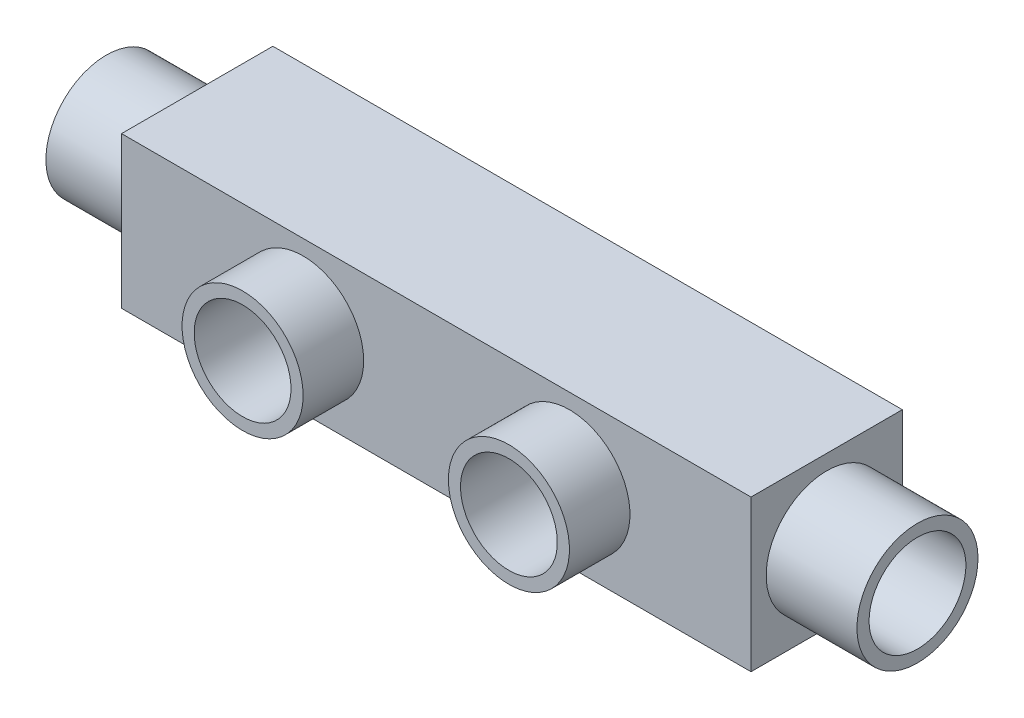
ISO-10303-21;
HEADER;
FILE_DESCRIPTION(('STEP AP214'),'2;1');
FILE_NAME('part.step','',(''),(''),'','','');
FILE_SCHEMA(('AUTOMOTIVE_DESIGN { 1 0 10303 214 1 1 1 1 }'));
ENDSEC;
DATA;
#1=APPLICATION_CONTEXT('core data for automotive mechanical design processes');
#2=APPLICATION_PROTOCOL_DEFINITION('international standard','automotive_design',2000,#1);
#3=PRODUCT_CONTEXT('',#1,'mechanical');
#4=PRODUCT('Part','Part','',(#3));
#5=PRODUCT_RELATED_PRODUCT_CATEGORY('part','',(#4));
#6=PRODUCT_DEFINITION_FORMATION('','',#4);
#7=PRODUCT_DEFINITION_CONTEXT('part definition',#1,'design');
#8=PRODUCT_DEFINITION('design','',#6,#7);
#9=PRODUCT_DEFINITION_SHAPE('','',#8);
#10=(LENGTH_UNIT() NAMED_UNIT(*) SI_UNIT(.MILLI.,.METRE.));
#11=(NAMED_UNIT(*) PLANE_ANGLE_UNIT() SI_UNIT($,.RADIAN.));
#12=(NAMED_UNIT(*) SI_UNIT($,.STERADIAN.) SOLID_ANGLE_UNIT());
#13=UNCERTAINTY_MEASURE_WITH_UNIT(LENGTH_MEASURE(1.E-05),#10,'distance_accuracy_value','');
#14=(GEOMETRIC_REPRESENTATION_CONTEXT(3) GLOBAL_UNCERTAINTY_ASSIGNED_CONTEXT((#13)) GLOBAL_UNIT_ASSIGNED_CONTEXT((#10,
#11,#12)) REPRESENTATION_CONTEXT('',''));
#15=CARTESIAN_POINT('',(0.,0.,0.));
#16=DIRECTION('',(0.,0.,1.));
#17=DIRECTION('',(1.,0.,0.));
#18=AXIS2_PLACEMENT_3D('',#15,#16,#17);
#19=CARTESIAN_POINT('',(35.,12.5,12.5));
#20=DIRECTION('',(-1.,0.,0.));
#21=DIRECTION('',(0.,0.,1.));
#22=AXIS2_PLACEMENT_3D('',#19,#20,#21);
#23=CYLINDRICAL_SURFACE('',#22,8.);
#24=CARTESIAN_POINT('',(-15.,12.5,12.5));
#25=DIRECTION('',(-1.,0.,0.));
#26=DIRECTION('',(0.,0.,1.));
#27=AXIS2_PLACEMENT_3D('',#24,#25,#26);
#28=CIRCLE('',#27,8.);
#29=CARTESIAN_POINT('',(-15.,12.5,20.5));
#30=VERTEX_POINT('',#29);
#31=EDGE_CURVE('E201',#30,#30,#28,.T.);
#32=ORIENTED_EDGE('',*,*,#31,.T.);
#33=EDGE_LOOP('',(#32));
#34=FACE_BOUND('',#33,.T.);
#35=CARTESIAN_POINT('',(30.,12.5,12.5));
#36=DIRECTION('',(-0.707106781186547,0.,-0.707106781186547));
#37=DIRECTION('',(-0.707106781186547,0.,0.707106781186547));
#38=AXIS2_PLACEMENT_3D('',#35,#36,#37);
#39=ELLIPSE('',#38,11.3137084989848,8.);
#40=CARTESIAN_POINT('',(30.,20.5,12.5));
#41=VERTEX_POINT('',#40);
#42=CARTESIAN_POINT('',(30.,4.5,12.5));
#43=VERTEX_POINT('',#42);
#44=EDGE_CURVE('E57',#41,#43,#39,.F.);
#45=ORIENTED_EDGE('',*,*,#44,.T.);
#46=CARTESIAN_POINT('',(30.,12.5,12.5));
#47=DIRECTION('',(-0.707106781186547,0.,0.707106781186547));
#48=DIRECTION('',(-0.707106781186547,0.,-0.707106781186547));
#49=AXIS2_PLACEMENT_3D('',#46,#47,#48);
#50=ELLIPSE('',#49,11.3137084989848,8.);
#51=EDGE_CURVE('E191',#43,#41,#50,.F.);
#52=ORIENTED_EDGE('',*,*,#51,.T.);
#53=EDGE_LOOP('',(#45,#52));
#54=FACE_BOUND('',#53,.T.);
#55=ADVANCED_FACE('F35',(#34,#54),#23,.F.);
#56=CARTESIAN_POINT('',(0.,0.,25.));
#57=DIRECTION('',(0.,1.,0.));
#58=DIRECTION('',(-1.,0.,0.));
#59=AXIS2_PLACEMENT_3D('',#56,#57,#58);
#60=PLANE('',#59);
#61=DIRECTION('',(1.,0.,0.));
#62=VECTOR('',#61,1.);
#63=CARTESIAN_POINT('',(0.,0.,0.));
#64=LINE('',#63,#62);
#65=CARTESIAN_POINT('',(0.,0.,0.));
#66=VERTEX_POINT('',#65);
#67=CARTESIAN_POINT('',(104.,0.,0.));
#68=VERTEX_POINT('',#67);
#69=EDGE_CURVE('E215',#66,#68,#64,.T.);
#70=ORIENTED_EDGE('',*,*,#69,.T.);
#71=DIRECTION('',(0.,0.,-1.));
#72=VECTOR('',#71,1.);
#73=CARTESIAN_POINT('',(104.,0.,25.));
#74=LINE('',#73,#72);
#75=CARTESIAN_POINT('',(104.,0.,25.));
#76=VERTEX_POINT('',#75);
#77=EDGE_CURVE('E170',#76,#68,#74,.T.);
#78=ORIENTED_EDGE('',*,*,#77,.F.);
#79=DIRECTION('',(1.,0.,0.));
#80=VECTOR('',#79,1.);
#81=CARTESIAN_POINT('',(0.,0.,25.));
#82=LINE('',#81,#80);
#83=CARTESIAN_POINT('',(0.,0.,25.));
#84=VERTEX_POINT('',#83);
#85=EDGE_CURVE('E216',#84,#76,#82,.T.);
#86=ORIENTED_EDGE('',*,*,#85,.F.);
#87=DIRECTION('',(0.,0.,-1.));
#88=VECTOR('',#87,1.);
#89=CARTESIAN_POINT('',(0.,0.,25.));
#90=LINE('',#89,#88);
#91=EDGE_CURVE('E224',#84,#66,#90,.T.);
#92=ORIENTED_EDGE('',*,*,#91,.T.);
#93=EDGE_LOOP('',(#70,#78,#86,#92));
#94=FACE_BOUND('',#93,.T.);
#95=ADVANCED_FACE('F37',(#94),#60,.F.);
#96=CARTESIAN_POINT('',(0.,25.,25.));
#97=DIRECTION('',(0.,1.,0.));
#98=DIRECTION('',(0.,0.,1.));
#99=AXIS2_PLACEMENT_3D('',#96,#97,#98);
#100=PLANE('',#99);
#101=DIRECTION('',(1.,0.,0.));
#102=VECTOR('',#101,1.);
#103=CARTESIAN_POINT('',(0.,25.,0.));
#104=LINE('',#103,#102);
#105=CARTESIAN_POINT('',(0.,25.,0.));
#106=VERTEX_POINT('',#105);
#107=CARTESIAN_POINT('',(104.,25.,0.));
#108=VERTEX_POINT('',#107);
#109=EDGE_CURVE('E226',#106,#108,#104,.T.);
#110=ORIENTED_EDGE('',*,*,#109,.F.);
#111=DIRECTION('',(0.,0.,-1.));
#112=VECTOR('',#111,1.);
#113=CARTESIAN_POINT('',(0.,25.,25.));
#114=LINE('',#113,#112);
#115=CARTESIAN_POINT('',(0.,25.,25.));
#116=VERTEX_POINT('',#115);
#117=EDGE_CURVE('E231',#116,#106,#114,.T.);
#118=ORIENTED_EDGE('',*,*,#117,.F.);
#119=DIRECTION('',(1.,0.,0.));
#120=VECTOR('',#119,1.);
#121=CARTESIAN_POINT('',(0.,25.,25.));
#122=LINE('',#121,#120);
#123=CARTESIAN_POINT('',(104.,25.,25.));
#124=VERTEX_POINT('',#123);
#125=EDGE_CURVE('E218',#116,#124,#122,.T.);
#126=ORIENTED_EDGE('',*,*,#125,.T.);
#127=DIRECTION('',(0.,0.,-1.));
#128=VECTOR('',#127,1.);
#129=CARTESIAN_POINT('',(104.,25.,25.));
#130=LINE('',#129,#128);
#131=EDGE_CURVE('E128',#124,#108,#130,.T.);
#132=ORIENTED_EDGE('',*,*,#131,.T.);
#133=EDGE_LOOP('',(#110,#118,#126,#132));
#134=FACE_BOUND('',#133,.T.);
#135=ADVANCED_FACE('F259',(#134),#100,.T.);
#136=CARTESIAN_POINT('',(0.,0.,25.));
#137=DIRECTION('',(-1.,0.,0.));
#138=DIRECTION('',(0.,0.,1.));
#139=AXIS2_PLACEMENT_3D('',#136,#137,#138);
#140=PLANE('',#139);
#141=CARTESIAN_POINT('',(0.,12.5,12.5));
#142=DIRECTION('',(1.,0.,0.));
#143=DIRECTION('',(0.,0.,-1.));
#144=AXIS2_PLACEMENT_3D('',#141,#142,#143);
#145=CIRCLE('',#144,10.);
#146=CARTESIAN_POINT('',(0.,12.5,2.5));
#147=VERTEX_POINT('',#146);
#148=EDGE_CURVE('E199',#147,#147,#145,.T.);
#149=ORIENTED_EDGE('',*,*,#148,.T.);
#150=EDGE_LOOP('',(#149));
#151=FACE_BOUND('',#150,.T.);
#152=DIRECTION('',(0.,1.,0.));
#153=VECTOR('',#152,1.);
#154=CARTESIAN_POINT('',(0.,0.,0.));
#155=LINE('',#154,#153);
#156=EDGE_CURVE('E219',#66,#106,#155,.T.);
#157=ORIENTED_EDGE('',*,*,#156,.F.);
#158=ORIENTED_EDGE('',*,*,#91,.F.);
#159=DIRECTION('',(0.,1.,0.));
#160=VECTOR('',#159,1.);
#161=CARTESIAN_POINT('',(0.,0.,25.));
#162=LINE('',#161,#160);
#163=EDGE_CURVE('E221',#84,#116,#162,.T.);
#164=ORIENTED_EDGE('',*,*,#163,.T.);
#165=ORIENTED_EDGE('',*,*,#117,.T.);
#166=EDGE_LOOP('',(#157,#158,#164,#165));
#167=FACE_BOUND('',#166,.T.);
#168=ADVANCED_FACE('F283',(#151,#167),#140,.T.);
#169=CARTESIAN_POINT('',(0.,0.,25.));
#170=DIRECTION('',(0.,0.,1.));
#171=DIRECTION('',(1.,0.,0.));
#172=AXIS2_PLACEMENT_3D('',#169,#170,#171);
#173=PLANE('',#172);
#174=CARTESIAN_POINT('',(30.,12.5,25.));
#175=DIRECTION('',(0.,0.,1.));
#176=DIRECTION('',(1.,0.,0.));
#177=AXIS2_PLACEMENT_3D('',#174,#175,#176);
#178=CIRCLE('',#177,10.);
#179=CARTESIAN_POINT('',(40.,12.5,25.));
#180=VERTEX_POINT('',#179);
#181=EDGE_CURVE('E212',#180,#180,#178,.F.);
#182=ORIENTED_EDGE('',*,*,#181,.T.);
#183=EDGE_LOOP('',(#182));
#184=FACE_BOUND('',#183,.T.);
#185=ORIENTED_EDGE('',*,*,#85,.T.);
#186=DIRECTION('',(0.,1.,0.));
#187=VECTOR('',#186,1.);
#188=CARTESIAN_POINT('',(104.,0.,25.));
#189=LINE('',#188,#187);
#190=EDGE_CURVE('E167',#76,#124,#189,.T.);
#191=ORIENTED_EDGE('',*,*,#190,.T.);
#192=ORIENTED_EDGE('',*,*,#125,.F.);
#193=ORIENTED_EDGE('',*,*,#163,.F.);
#194=EDGE_LOOP('',(#185,#191,#192,#193));
#195=FACE_BOUND('',#194,.T.);
#196=CARTESIAN_POINT('',(74.,12.5,25.));
#197=DIRECTION('',(0.,0.,-1.));
#198=DIRECTION('',(-1.,0.,0.));
#199=AXIS2_PLACEMENT_3D('',#196,#197,#198);
#200=CIRCLE('',#199,10.);
#201=CARTESIAN_POINT('',(64.,12.5,25.));
#202=VERTEX_POINT('',#201);
#203=EDGE_CURVE('E163',#202,#202,#200,.F.);
#204=ORIENTED_EDGE('',*,*,#203,.F.);
#205=EDGE_LOOP('',(#204));
#206=FACE_BOUND('',#205,.T.);
#207=ADVANCED_FACE('F280',(#184,#195,#206),#173,.T.);
#208=CARTESIAN_POINT('',(0.,0.,0.));
#209=DIRECTION('',(0.,0.,1.));
#210=DIRECTION('',(1.,0.,0.));
#211=AXIS2_PLACEMENT_3D('',#208,#209,#210);
#212=PLANE('',#211);
#213=ORIENTED_EDGE('',*,*,#69,.F.);
#214=ORIENTED_EDGE('',*,*,#156,.T.);
#215=ORIENTED_EDGE('',*,*,#109,.T.);
#216=DIRECTION('',(0.,1.,0.));
#217=VECTOR('',#216,1.);
#218=CARTESIAN_POINT('',(104.,0.,0.));
#219=LINE('',#218,#217);
#220=EDGE_CURVE('E166',#68,#108,#219,.T.);
#221=ORIENTED_EDGE('',*,*,#220,.F.);
#222=EDGE_LOOP('',(#213,#214,#215,#221));
#223=FACE_BOUND('',#222,.T.);
#224=ADVANCED_FACE('F278',(#223),#212,.F.);
#225=CARTESIAN_POINT('',(30.,12.5,35.));
#226=DIRECTION('',(0.,0.,-1.));
#227=DIRECTION('',(-1.,0.,0.));
#228=AXIS2_PLACEMENT_3D('',#225,#226,#227);
#229=CYLINDRICAL_SURFACE('',#228,10.);
#230=ORIENTED_EDGE('',*,*,#181,.F.);
#231=EDGE_LOOP('',(#230));
#232=FACE_BOUND('',#231,.T.);
#233=CARTESIAN_POINT('',(30.,12.5,35.));
#234=DIRECTION('',(0.,0.,1.));
#235=DIRECTION('',(1.,0.,0.));
#236=AXIS2_PLACEMENT_3D('',#233,#234,#235);
#237=CIRCLE('',#236,10.);
#238=CARTESIAN_POINT('',(40.,12.5,35.));
#239=VERTEX_POINT('',#238);
#240=EDGE_CURVE('E207',#239,#239,#237,.T.);
#241=ORIENTED_EDGE('',*,*,#240,.F.);
#242=EDGE_LOOP('',(#241));
#243=FACE_BOUND('',#242,.T.);
#244=ADVANCED_FACE('F274',(#232,#243),#229,.T.);
#245=CARTESIAN_POINT('',(0.,0.,35.));
#246=DIRECTION('',(0.,0.,1.));
#247=DIRECTION('',(1.,0.,0.));
#248=AXIS2_PLACEMENT_3D('',#245,#246,#247);
#249=PLANE('',#248);
#250=CARTESIAN_POINT('',(30.,12.5,35.));
#251=DIRECTION('',(0.,0.,1.));
#252=DIRECTION('',(1.,0.,0.));
#253=AXIS2_PLACEMENT_3D('',#250,#251,#252);
#254=CIRCLE('',#253,8.);
#255=CARTESIAN_POINT('',(38.,12.5,35.));
#256=VERTEX_POINT('',#255);
#257=EDGE_CURVE('E179',#256,#256,#254,.T.);
#258=ORIENTED_EDGE('',*,*,#257,.F.);
#259=EDGE_LOOP('',(#258));
#260=FACE_BOUND('',#259,.T.);
#261=ORIENTED_EDGE('',*,*,#240,.T.);
#262=EDGE_LOOP('',(#261));
#263=FACE_BOUND('',#262,.T.);
#264=ADVANCED_FACE('F270',(#260,#263),#249,.T.);
#265=CARTESIAN_POINT('',(-15.,12.5,12.5));
#266=DIRECTION('',(1.,0.,0.));
#267=DIRECTION('',(0.,0.,-1.));
#268=AXIS2_PLACEMENT_3D('',#265,#266,#267);
#269=CYLINDRICAL_SURFACE('',#268,10.);
#270=CARTESIAN_POINT('',(-15.,12.5,12.5));
#271=DIRECTION('',(1.,0.,0.));
#272=DIRECTION('',(0.,0.,-1.));
#273=AXIS2_PLACEMENT_3D('',#270,#271,#272);
#274=CIRCLE('',#273,10.);
#275=CARTESIAN_POINT('',(-15.,12.5,2.5));
#276=VERTEX_POINT('',#275);
#277=EDGE_CURVE('E204',#276,#276,#274,.T.);
#278=ORIENTED_EDGE('',*,*,#277,.T.);
#279=EDGE_LOOP('',(#278));
#280=FACE_BOUND('',#279,.T.);
#281=ORIENTED_EDGE('',*,*,#148,.F.);
#282=EDGE_LOOP('',(#281));
#283=FACE_BOUND('',#282,.T.);
#284=ADVANCED_FACE('F266',(#280,#283),#269,.T.);
#285=CARTESIAN_POINT('',(-15.,12.5,12.5));
#286=DIRECTION('',(1.,0.,0.));
#287=DIRECTION('',(0.,0.,-1.));
#288=AXIS2_PLACEMENT_3D('',#285,#286,#287);
#289=PLANE('',#288);
#290=ORIENTED_EDGE('',*,*,#31,.F.);
#291=EDGE_LOOP('',(#290));
#292=FACE_BOUND('',#291,.T.);
#293=ORIENTED_EDGE('',*,*,#277,.F.);
#294=EDGE_LOOP('',(#293));
#295=FACE_BOUND('',#294,.T.);
#296=ADVANCED_FACE('F263',(#292,#295),#289,.F.);
#297=CARTESIAN_POINT('',(30.,12.5,3.99999999999999));
#298=DIRECTION('',(0.,0.,1.));
#299=DIRECTION('',(1.,0.,0.));
#300=AXIS2_PLACEMENT_3D('',#297,#298,#299);
#301=CYLINDRICAL_SURFACE('',#300,8.);
#302=CARTESIAN_POINT('',(30.,12.5,3.99999999999999));
#303=DIRECTION('',(0.,0.,1.));
#304=DIRECTION('',(1.,0.,0.));
#305=AXIS2_PLACEMENT_3D('',#302,#303,#304);
#306=CIRCLE('',#305,8.);
#307=CARTESIAN_POINT('',(38.,12.5,3.99999999999999));
#308=VERTEX_POINT('',#307);
#309=EDGE_CURVE('E180',#308,#308,#306,.T.);
#310=ORIENTED_EDGE('',*,*,#309,.F.);
#311=EDGE_LOOP('',(#310));
#312=FACE_BOUND('',#311,.T.);
#313=ORIENTED_EDGE('',*,*,#257,.T.);
#314=EDGE_LOOP('',(#313));
#315=FACE_BOUND('',#314,.T.);
#316=ORIENTED_EDGE('',*,*,#44,.F.);
#317=CARTESIAN_POINT('',(30.,12.5,12.5));
#318=DIRECTION('',(-0.707106781186547,0.,0.707106781186547));
#319=DIRECTION('',(-0.707106781186547,0.,-0.707106781186547));
#320=AXIS2_PLACEMENT_3D('',#317,#318,#319);
#321=ELLIPSE('',#320,11.3137084989848,8.);
#322=CARTESIAN_POINT('',(35.,18.7449979983984,17.5));
#323=VERTEX_POINT('',#322);
#324=EDGE_CURVE('E188',#323,#41,#321,.T.);
#325=ORIENTED_EDGE('',*,*,#324,.F.);
#326=DIRECTION('',(0.,0.,1.));
#327=VECTOR('',#326,1.);
#328=CARTESIAN_POINT('',(35.,18.7449979983984,3.99999999999999));
#329=LINE('',#328,#327);
#330=CARTESIAN_POINT('',(35.,18.7449979983984,7.49999999999995));
#331=VERTEX_POINT('',#330);
#332=EDGE_CURVE('E43',#323,#331,#329,.F.);
#333=ORIENTED_EDGE('',*,*,#332,.T.);
#334=CARTESIAN_POINT('',(30.,12.5,12.5));
#335=DIRECTION('',(-0.707106781186547,0.,-0.707106781186547));
#336=DIRECTION('',(-0.707106781186547,0.,0.707106781186547));
#337=AXIS2_PLACEMENT_3D('',#334,#335,#336);
#338=ELLIPSE('',#337,11.3137084989848,8.);
#339=EDGE_CURVE('E183',#41,#331,#338,.T.);
#340=ORIENTED_EDGE('',*,*,#339,.F.);
#341=ORIENTED_EDGE('',*,*,#51,.F.);
#342=CARTESIAN_POINT('',(35.,6.25500200160164,7.49999999999995));
#343=VERTEX_POINT('',#342);
#344=EDGE_CURVE('E50',#343,#43,#338,.T.);
#345=ORIENTED_EDGE('',*,*,#344,.F.);
#346=DIRECTION('',(0.,0.,1.));
#347=VECTOR('',#346,1.);
#348=CARTESIAN_POINT('',(35.,6.25500200160164,3.99999999999999));
#349=LINE('',#348,#347);
#350=CARTESIAN_POINT('',(35.,6.25500200160164,17.5000000000001));
#351=VERTEX_POINT('',#350);
#352=EDGE_CURVE('E11',#343,#351,#349,.T.);
#353=ORIENTED_EDGE('',*,*,#352,.T.);
#354=EDGE_CURVE('E192',#43,#351,#321,.T.);
#355=ORIENTED_EDGE('',*,*,#354,.F.);
#356=EDGE_LOOP('',(#316,#325,#333,#340,#341,#345,#353,#355));
#357=FACE_BOUND('',#356,.T.);
#358=ADVANCED_FACE('F233',(#312,#315,#357),#301,.F.);
#359=CARTESIAN_POINT('',(30.,12.5,3.99999999999999));
#360=DIRECTION('',(0.,0.,1.));
#361=DIRECTION('',(1.,0.,0.));
#362=AXIS2_PLACEMENT_3D('',#359,#360,#361);
#363=PLANE('',#362);
#364=ORIENTED_EDGE('',*,*,#309,.T.);
#365=EDGE_LOOP('',(#364));
#366=FACE_BOUND('',#365,.T.);
#367=ADVANCED_FACE('F252',(#366),#363,.T.);
#368=CARTESIAN_POINT('',(35.,12.5,12.5));
#369=DIRECTION('',(-1.,0.,0.));
#370=DIRECTION('',(0.,0.,1.));
#371=AXIS2_PLACEMENT_3D('',#368,#369,#370);
#372=PLANE('',#371);
#373=ORIENTED_EDGE('',*,*,#352,.F.);
#374=CARTESIAN_POINT('',(35.,12.5,12.5));
#375=DIRECTION('',(-1.,0.,0.));
#376=DIRECTION('',(0.,0.,1.));
#377=AXIS2_PLACEMENT_3D('',#374,#375,#376);
#378=CIRCLE('',#377,8.);
#379=EDGE_CURVE('E200',#343,#351,#378,.T.);
#380=ORIENTED_EDGE('',*,*,#379,.T.);
#381=EDGE_LOOP('',(#373,#380));
#382=FACE_BOUND('',#381,.T.);
#383=ADVANCED_FACE('F243',(#382),#372,.T.);
#384=ORIENTED_EDGE('',*,*,#344,.T.);
#385=ORIENTED_EDGE('',*,*,#354,.T.);
#386=ORIENTED_EDGE('',*,*,#379,.F.);
#387=EDGE_LOOP('',(#384,#385,#386));
#388=FACE_BOUND('',#387,.T.);
#389=ADVANCED_FACE('F241',(#388),#23,.F.);
#390=ORIENTED_EDGE('',*,*,#332,.F.);
#391=EDGE_CURVE('E196',#323,#331,#378,.T.);
#392=ORIENTED_EDGE('',*,*,#391,.T.);
#393=EDGE_LOOP('',(#390,#392));
#394=FACE_BOUND('',#393,.T.);
#395=ADVANCED_FACE('F239',(#394),#372,.T.);
#396=ORIENTED_EDGE('',*,*,#391,.F.);
#397=ORIENTED_EDGE('',*,*,#324,.T.);
#398=ORIENTED_EDGE('',*,*,#339,.T.);
#399=EDGE_LOOP('',(#396,#397,#398));
#400=FACE_BOUND('',#399,.T.);
#401=ADVANCED_FACE('F238',(#400),#23,.F.);
#402=CARTESIAN_POINT('',(68.9999999999999,12.5,12.5));
#403=DIRECTION('',(1.,0.,0.));
#404=DIRECTION('',(0.,0.,1.));
#405=AXIS2_PLACEMENT_3D('',#402,#403,#404);
#406=CYLINDRICAL_SURFACE('',#405,8.);
#407=CARTESIAN_POINT('',(119.,12.5,12.5));
#408=DIRECTION('',(-1.,0.,0.));
#409=DIRECTION('',(0.,0.,1.));
#410=AXIS2_PLACEMENT_3D('',#407,#408,#409);
#411=CIRCLE('',#410,8.);
#412=CARTESIAN_POINT('',(119.,12.5,20.5));
#413=VERTEX_POINT('',#412);
#414=EDGE_CURVE('E149',#413,#413,#411,.T.);
#415=ORIENTED_EDGE('',*,*,#414,.F.);
#416=EDGE_LOOP('',(#415));
#417=FACE_BOUND('',#416,.T.);
#418=CARTESIAN_POINT('',(74.,12.5,12.5));
#419=DIRECTION('',(-0.707106781186547,0.,0.707106781186547));
#420=DIRECTION('',(0.707106781186547,0.,0.707106781186547));
#421=AXIS2_PLACEMENT_3D('',#418,#419,#420);
#422=ELLIPSE('',#421,11.3137084989848,8.);
#423=CARTESIAN_POINT('',(74.,20.5,12.5));
#424=VERTEX_POINT('',#423);
#425=CARTESIAN_POINT('',(74.,4.5,12.5));
#426=VERTEX_POINT('',#425);
#427=EDGE_CURVE('E144',#424,#426,#422,.F.);
#428=ORIENTED_EDGE('',*,*,#427,.F.);
#429=CARTESIAN_POINT('',(74.,12.5,12.5));
#430=DIRECTION('',(-0.707106781186547,0.,-0.707106781186547));
#431=DIRECTION('',(0.707106781186547,0.,-0.707106781186547));
#432=AXIS2_PLACEMENT_3D('',#429,#430,#431);
#433=ELLIPSE('',#432,11.3137084989848,8.);
#434=EDGE_CURVE('E133',#426,#424,#433,.F.);
#435=ORIENTED_EDGE('',*,*,#434,.F.);
#436=EDGE_LOOP('',(#428,#435));
#437=FACE_BOUND('',#436,.T.);
#438=ADVANCED_FACE('F248',(#417,#437),#406,.F.);
#439=CARTESIAN_POINT('',(104.,0.,25.));
#440=DIRECTION('',(1.,0.,0.));
#441=DIRECTION('',(0.,0.,1.));
#442=AXIS2_PLACEMENT_3D('',#439,#440,#441);
#443=PLANE('',#442);
#444=CARTESIAN_POINT('',(104.,12.5,12.5));
#445=DIRECTION('',(1.,0.,0.));
#446=DIRECTION('',(0.,0.,-1.));
#447=AXIS2_PLACEMENT_3D('',#444,#445,#446);
#448=CIRCLE('',#447,10.);
#449=CARTESIAN_POINT('',(104.,12.5,2.5));
#450=VERTEX_POINT('',#449);
#451=EDGE_CURVE('E121',#450,#450,#448,.T.);
#452=ORIENTED_EDGE('',*,*,#451,.F.);
#453=EDGE_LOOP('',(#452));
#454=FACE_BOUND('',#453,.T.);
#455=ORIENTED_EDGE('',*,*,#220,.T.);
#456=ORIENTED_EDGE('',*,*,#131,.F.);
#457=ORIENTED_EDGE('',*,*,#190,.F.);
#458=ORIENTED_EDGE('',*,*,#77,.T.);
#459=EDGE_LOOP('',(#455,#456,#457,#458));
#460=FACE_BOUND('',#459,.T.);
#461=ADVANCED_FACE('F308',(#454,#460),#443,.T.);
#462=CARTESIAN_POINT('',(74.,12.5,35.));
#463=DIRECTION('',(0.,0.,-1.));
#464=DIRECTION('',(1.,0.,0.));
#465=AXIS2_PLACEMENT_3D('',#462,#463,#464);
#466=CYLINDRICAL_SURFACE('',#465,10.);
#467=ORIENTED_EDGE('',*,*,#203,.T.);
#468=EDGE_LOOP('',(#467));
#469=FACE_BOUND('',#468,.T.);
#470=CARTESIAN_POINT('',(74.,12.5,35.));
#471=DIRECTION('',(0.,0.,-1.));
#472=DIRECTION('',(-1.,0.,0.));
#473=AXIS2_PLACEMENT_3D('',#470,#471,#472);
#474=CIRCLE('',#473,10.);
#475=CARTESIAN_POINT('',(64.,12.5,35.));
#476=VERTEX_POINT('',#475);
#477=EDGE_CURVE('E158',#476,#476,#474,.T.);
#478=ORIENTED_EDGE('',*,*,#477,.T.);
#479=EDGE_LOOP('',(#478));
#480=FACE_BOUND('',#479,.T.);
#481=ADVANCED_FACE('F310',(#469,#480),#466,.T.);
#482=CARTESIAN_POINT('',(104.,0.,35.));
#483=DIRECTION('',(0.,0.,1.));
#484=DIRECTION('',(-1.,0.,0.));
#485=AXIS2_PLACEMENT_3D('',#482,#483,#484);
#486=PLANE('',#485);
#487=CARTESIAN_POINT('',(74.,12.5,35.));
#488=DIRECTION('',(0.,0.,-1.));
#489=DIRECTION('',(-1.,0.,0.));
#490=AXIS2_PLACEMENT_3D('',#487,#488,#489);
#491=CIRCLE('',#490,8.);
#492=CARTESIAN_POINT('',(66.,12.5,35.));
#493=VERTEX_POINT('',#492);
#494=EDGE_CURVE('E141',#493,#493,#491,.T.);
#495=ORIENTED_EDGE('',*,*,#494,.T.);
#496=EDGE_LOOP('',(#495));
#497=FACE_BOUND('',#496,.T.);
#498=ORIENTED_EDGE('',*,*,#477,.F.);
#499=EDGE_LOOP('',(#498));
#500=FACE_BOUND('',#499,.T.);
#501=ADVANCED_FACE('F317',(#497,#500),#486,.T.);
#502=CARTESIAN_POINT('',(119.,12.5,12.5));
#503=DIRECTION('',(-1.,0.,0.));
#504=DIRECTION('',(0.,0.,-1.));
#505=AXIS2_PLACEMENT_3D('',#502,#503,#504);
#506=CYLINDRICAL_SURFACE('',#505,10.);
#507=CARTESIAN_POINT('',(119.,12.5,12.5));
#508=DIRECTION('',(1.,0.,0.));
#509=DIRECTION('',(0.,0.,-1.));
#510=AXIS2_PLACEMENT_3D('',#507,#508,#509);
#511=CIRCLE('',#510,10.);
#512=CARTESIAN_POINT('',(119.,12.5,2.5));
#513=VERTEX_POINT('',#512);
#514=EDGE_CURVE('E155',#513,#513,#511,.T.);
#515=ORIENTED_EDGE('',*,*,#514,.F.);
#516=EDGE_LOOP('',(#515));
#517=FACE_BOUND('',#516,.T.);
#518=ORIENTED_EDGE('',*,*,#451,.T.);
#519=EDGE_LOOP('',(#518));
#520=FACE_BOUND('',#519,.T.);
#521=ADVANCED_FACE('F440',(#517,#520),#506,.T.);
#522=CARTESIAN_POINT('',(119.,12.5,12.5));
#523=DIRECTION('',(-1.,0.,0.));
#524=DIRECTION('',(0.,0.,-1.));
#525=AXIS2_PLACEMENT_3D('',#522,#523,#524);
#526=PLANE('',#525);
#527=ORIENTED_EDGE('',*,*,#414,.T.);
#528=EDGE_LOOP('',(#527));
#529=FACE_BOUND('',#528,.T.);
#530=ORIENTED_EDGE('',*,*,#514,.T.);
#531=EDGE_LOOP('',(#530));
#532=FACE_BOUND('',#531,.T.);
#533=ADVANCED_FACE('F449',(#529,#532),#526,.F.);
#534=CARTESIAN_POINT('',(74.,12.5,3.99999999999999));
#535=DIRECTION('',(0.,0.,1.));
#536=DIRECTION('',(-1.,0.,0.));
#537=AXIS2_PLACEMENT_3D('',#534,#535,#536);
#538=CYLINDRICAL_SURFACE('',#537,8.);
#539=CARTESIAN_POINT('',(74.,12.5,3.99999999999999));
#540=DIRECTION('',(0.,0.,-1.));
#541=DIRECTION('',(-1.,0.,0.));
#542=AXIS2_PLACEMENT_3D('',#539,#540,#541);
#543=CIRCLE('',#542,8.);
#544=CARTESIAN_POINT('',(66.,12.5,3.99999999999999));
#545=VERTEX_POINT('',#544);
#546=EDGE_CURVE('E135',#545,#545,#543,.T.);
#547=ORIENTED_EDGE('',*,*,#546,.T.);
#548=EDGE_LOOP('',(#547));
#549=FACE_BOUND('',#548,.T.);
#550=ORIENTED_EDGE('',*,*,#494,.F.);
#551=EDGE_LOOP('',(#550));
#552=FACE_BOUND('',#551,.T.);
#553=ORIENTED_EDGE('',*,*,#427,.T.);
#554=CARTESIAN_POINT('',(74.,12.5,12.5));
#555=DIRECTION('',(-0.707106781186547,0.,-0.707106781186547));
#556=DIRECTION('',(0.707106781186547,0.,-0.707106781186547));
#557=AXIS2_PLACEMENT_3D('',#554,#555,#556);
#558=ELLIPSE('',#557,11.3137084989848,8.);
#559=CARTESIAN_POINT('',(68.9999999999999,6.25500200160164,17.5000000000001));
#560=VERTEX_POINT('',#559);
#561=EDGE_CURVE('E139',#426,#560,#558,.T.);
#562=ORIENTED_EDGE('',*,*,#561,.T.);
#563=DIRECTION('',(0.,0.,1.));
#564=VECTOR('',#563,1.);
#565=CARTESIAN_POINT('',(68.9999999999999,6.25500200160164,3.99999999999999));
#566=LINE('',#565,#564);
#567=CARTESIAN_POINT('',(68.9999999999999,6.25500200160164,7.49999999999995));
#568=VERTEX_POINT('',#567);
#569=EDGE_CURVE('E127',#568,#560,#566,.T.);
#570=ORIENTED_EDGE('',*,*,#569,.F.);
#571=CARTESIAN_POINT('',(74.,12.5,12.5));
#572=DIRECTION('',(-0.707106781186547,0.,0.707106781186547));
#573=DIRECTION('',(0.707106781186547,0.,0.707106781186547));
#574=AXIS2_PLACEMENT_3D('',#571,#572,#573);
#575=ELLIPSE('',#574,11.3137084989848,8.);
#576=EDGE_CURVE('E137',#568,#426,#575,.T.);
#577=ORIENTED_EDGE('',*,*,#576,.T.);
#578=ORIENTED_EDGE('',*,*,#434,.T.);
#579=CARTESIAN_POINT('',(68.9999999999999,18.7449979983984,7.49999999999995));
#580=VERTEX_POINT('',#579);
#581=EDGE_CURVE('E116',#424,#580,#575,.T.);
#582=ORIENTED_EDGE('',*,*,#581,.T.);
#583=DIRECTION('',(0.,0.,1.));
#584=VECTOR('',#583,1.);
#585=CARTESIAN_POINT('',(68.9999999999999,18.7449979983984,3.99999999999999));
#586=LINE('',#585,#584);
#587=CARTESIAN_POINT('',(68.9999999999999,18.7449979983984,17.5));
#588=VERTEX_POINT('',#587);
#589=EDGE_CURVE('E124',#588,#580,#586,.F.);
#590=ORIENTED_EDGE('',*,*,#589,.F.);
#591=EDGE_CURVE('E118',#588,#424,#558,.T.);
#592=ORIENTED_EDGE('',*,*,#591,.T.);
#593=EDGE_LOOP('',(#553,#562,#570,#577,#578,#582,#590,#592));
#594=FACE_BOUND('',#593,.T.);
#595=ADVANCED_FACE('F131',(#549,#552,#594),#538,.F.);
#596=CARTESIAN_POINT('',(74.,12.5,3.99999999999999));
#597=DIRECTION('',(0.,0.,1.));
#598=DIRECTION('',(-1.,0.,0.));
#599=AXIS2_PLACEMENT_3D('',#596,#597,#598);
#600=PLANE('',#599);
#601=ORIENTED_EDGE('',*,*,#546,.F.);
#602=EDGE_LOOP('',(#601));
#603=FACE_BOUND('',#602,.T.);
#604=ADVANCED_FACE('F468',(#603),#600,.T.);
#605=CARTESIAN_POINT('',(68.9999999999999,12.5,12.5));
#606=DIRECTION('',(1.,0.,0.));
#607=DIRECTION('',(0.,0.,1.));
#608=AXIS2_PLACEMENT_3D('',#605,#606,#607);
#609=PLANE('',#608);
#610=ORIENTED_EDGE('',*,*,#569,.T.);
#611=CARTESIAN_POINT('',(68.9999999999999,12.5,12.5));
#612=DIRECTION('',(-1.,0.,0.));
#613=DIRECTION('',(0.,0.,1.));
#614=AXIS2_PLACEMENT_3D('',#611,#612,#613);
#615=CIRCLE('',#614,8.);
#616=EDGE_CURVE('E122',#568,#560,#615,.T.);
#617=ORIENTED_EDGE('',*,*,#616,.F.);
#618=EDGE_LOOP('',(#610,#617));
#619=FACE_BOUND('',#618,.T.);
#620=ADVANCED_FACE('F478',(#619),#609,.T.);
#621=ORIENTED_EDGE('',*,*,#576,.F.);
#622=ORIENTED_EDGE('',*,*,#616,.T.);
#623=ORIENTED_EDGE('',*,*,#561,.F.);
#624=EDGE_LOOP('',(#621,#622,#623));
#625=FACE_BOUND('',#624,.T.);
#626=ADVANCED_FACE('F322',(#625),#406,.F.);
#627=ORIENTED_EDGE('',*,*,#589,.T.);
#628=EDGE_CURVE('E112',#588,#580,#615,.T.);
#629=ORIENTED_EDGE('',*,*,#628,.F.);
#630=EDGE_LOOP('',(#627,#629));
#631=FACE_BOUND('',#630,.T.);
#632=ADVANCED_FACE('F125',(#631),#609,.T.);
#633=ORIENTED_EDGE('',*,*,#628,.T.);
#634=ORIENTED_EDGE('',*,*,#581,.F.);
#635=ORIENTED_EDGE('',*,*,#591,.F.);
#636=EDGE_LOOP('',(#633,#634,#635));
#637=FACE_BOUND('',#636,.T.);
#638=ADVANCED_FACE('F114',(#637),#406,.F.);
#639=CLOSED_SHELL('',(#55,#95,#135,#168,#207,#224,#244,#264,#284,#296,#358,#367,#383,#389,#395,
#401,#438,#461,#481,#501,#521,#533,#595,#604,#620,#626,#632,#638));
#640=MANIFOLD_SOLID_BREP('B2',#639);
#641=ADVANCED_BREP_SHAPE_REPRESENTATION('',(#18,#640),#14);
#642=SHAPE_DEFINITION_REPRESENTATION(#9,#641);
ENDSEC;
END-ISO-10303-21;
